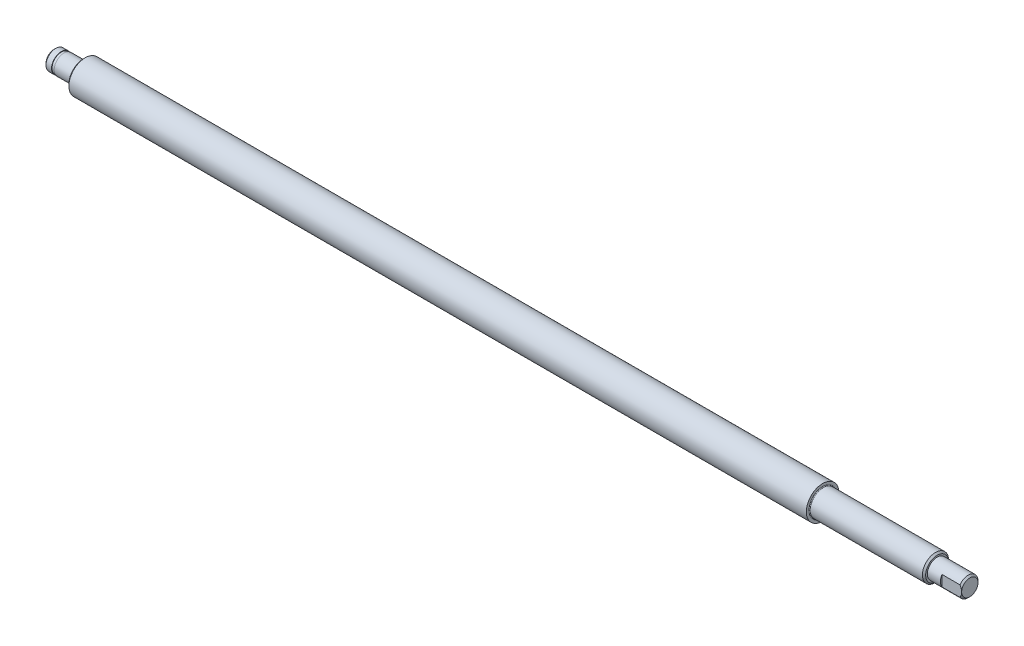
ISO-10303-21;
HEADER;
FILE_DESCRIPTION(('STEP AP214'),'2;1');
FILE_NAME('part.step','',(''),(''),'','','');
FILE_SCHEMA(('AUTOMOTIVE_DESIGN { 1 0 10303 214 1 1 1 1 }'));
ENDSEC;
DATA;
#1=APPLICATION_CONTEXT('core data for automotive mechanical design processes');
#2=APPLICATION_PROTOCOL_DEFINITION('international standard','automotive_design',2000,#1);
#3=PRODUCT_CONTEXT('',#1,'mechanical');
#4=PRODUCT('Part','Part','',(#3));
#5=PRODUCT_RELATED_PRODUCT_CATEGORY('part','',(#4));
#6=PRODUCT_DEFINITION_FORMATION('','',#4);
#7=PRODUCT_DEFINITION_CONTEXT('part definition',#1,'design');
#8=PRODUCT_DEFINITION('design','',#6,#7);
#9=PRODUCT_DEFINITION_SHAPE('','',#8);
#10=(LENGTH_UNIT() NAMED_UNIT(*) SI_UNIT(.MILLI.,.METRE.));
#11=(NAMED_UNIT(*) PLANE_ANGLE_UNIT() SI_UNIT($,.RADIAN.));
#12=(NAMED_UNIT(*) SI_UNIT($,.STERADIAN.) SOLID_ANGLE_UNIT());
#13=UNCERTAINTY_MEASURE_WITH_UNIT(LENGTH_MEASURE(1.E-05),#10,'distance_accuracy_value','');
#14=(GEOMETRIC_REPRESENTATION_CONTEXT(3) GLOBAL_UNCERTAINTY_ASSIGNED_CONTEXT((#13)) GLOBAL_UNIT_ASSIGNED_CONTEXT((#10,
#11,#12)) REPRESENTATION_CONTEXT('',''));
#15=CARTESIAN_POINT('',(0.,0.,0.));
#16=DIRECTION('',(0.,0.,1.));
#17=DIRECTION('',(1.,0.,0.));
#18=AXIS2_PLACEMENT_3D('',#15,#16,#17);
#19=CARTESIAN_POINT('',(0.,1.25,0.));
#20=DIRECTION('',(-1.,0.,0.));
#21=DIRECTION('',(0.,0.,1.));
#22=AXIS2_PLACEMENT_3D('',#19,#20,#21);
#23=PLANE('',#22);
#24=CARTESIAN_POINT('',(-5.6843418860808E-11,0.,0.));
#25=DIRECTION('',(1.,0.,0.));
#26=DIRECTION('',(0.,0.,-1.));
#27=AXIS2_PLACEMENT_3D('',#24,#25,#26);
#28=CIRCLE('',#27,2.49999999994088);
#29=CARTESIAN_POINT('',(-5.6843418860808E-11,0.,-2.49999999994088));
#30=VERTEX_POINT('',#29);
#31=EDGE_CURVE('E175',#30,#30,#28,.T.);
#32=ORIENTED_EDGE('',*,*,#31,.F.);
#33=EDGE_LOOP('',(#32));
#34=FACE_BOUND('',#33,.T.);
#35=ADVANCED_FACE('F17',(#34),#23,.T.);
#36=CARTESIAN_POINT('',(0.49999999987449,0.,0.));
#37=DIRECTION('',(1.,0.,0.));
#38=DIRECTION('',(0.,0.,-1.));
#39=AXIS2_PLACEMENT_3D('',#36,#37,#38);
#40=CONICAL_SURFACE('',#39,2.99999999987222,0.785398163397448);
#41=ORIENTED_EDGE('',*,*,#31,.T.);
#42=EDGE_LOOP('',(#41));
#43=FACE_BOUND('',#42,.T.);
#44=CARTESIAN_POINT('',(0.5,0.,0.));
#45=DIRECTION('',(1.,0.,0.));
#46=DIRECTION('',(0.,0.,-1.));
#47=AXIS2_PLACEMENT_3D('',#44,#45,#46);
#48=CIRCLE('',#47,3.);
#49=CARTESIAN_POINT('',(0.5,0.,-3.));
#50=VERTEX_POINT('',#49);
#51=EDGE_CURVE('E173',#50,#50,#48,.T.);
#52=ORIENTED_EDGE('',*,*,#51,.F.);
#53=EDGE_LOOP('',(#52));
#54=FACE_BOUND('',#53,.T.);
#55=ADVANCED_FACE('F208',(#43,#54),#40,.T.);
#56=CARTESIAN_POINT('',(1.35,0.,0.));
#57=DIRECTION('',(1.,0.,0.));
#58=DIRECTION('',(0.,0.,-1.));
#59=AXIS2_PLACEMENT_3D('',#56,#57,#58);
#60=CYLINDRICAL_SURFACE('',#59,3.);
#61=ORIENTED_EDGE('',*,*,#51,.T.);
#62=EDGE_LOOP('',(#61));
#63=FACE_BOUND('',#62,.T.);
#64=CARTESIAN_POINT('',(2.2,0.,0.));
#65=DIRECTION('',(1.,0.,0.));
#66=DIRECTION('',(0.,0.,-1.));
#67=AXIS2_PLACEMENT_3D('',#64,#65,#66);
#68=CIRCLE('',#67,3.);
#69=CARTESIAN_POINT('',(2.2,0.,-3.));
#70=VERTEX_POINT('',#69);
#71=EDGE_CURVE('E89',#70,#70,#68,.T.);
#72=ORIENTED_EDGE('',*,*,#71,.F.);
#73=EDGE_LOOP('',(#72));
#74=FACE_BOUND('',#73,.T.);
#75=ADVANCED_FACE('F206',(#63,#74),#60,.T.);
#76=CARTESIAN_POINT('',(280.,1.25,0.));
#77=DIRECTION('',(1.,0.,0.));
#78=DIRECTION('',(0.,0.,-1.));
#79=AXIS2_PLACEMENT_3D('',#76,#77,#78);
#80=PLANE('',#79);
#81=CARTESIAN_POINT('',(280.00000000003,0.,0.));
#82=DIRECTION('',(-1.,0.,0.));
#83=DIRECTION('',(0.,0.,1.));
#84=AXIS2_PLACEMENT_3D('',#81,#82,#83);
#85=CIRCLE('',#84,2.49999999994088);
#86=CARTESIAN_POINT('',(280.,0.,2.49999999997044));
#87=VERTEX_POINT('',#86);
#88=EDGE_CURVE('E73',#87,#87,#85,.T.);
#89=ORIENTED_EDGE('',*,*,#88,.F.);
#90=EDGE_LOOP('',(#89));
#91=FACE_BOUND('',#90,.T.);
#92=ADVANCED_FACE('F201',(#91),#80,.T.);
#93=CARTESIAN_POINT('',(2.2,2.925,0.));
#94=DIRECTION('',(1.,0.,0.));
#95=DIRECTION('',(0.,0.,-1.));
#96=AXIS2_PLACEMENT_3D('',#93,#94,#95);
#97=PLANE('',#96);
#98=CARTESIAN_POINT('',(2.2,0.,0.));
#99=DIRECTION('',(1.,0.,0.));
#100=DIRECTION('',(0.,0.,-1.));
#101=AXIS2_PLACEMENT_3D('',#98,#99,#100);
#102=CIRCLE('',#101,2.85);
#103=CARTESIAN_POINT('',(2.2,0.,-2.85));
#104=VERTEX_POINT('',#103);
#105=EDGE_CURVE('E80',#104,#104,#102,.T.);
#106=ORIENTED_EDGE('',*,*,#105,.F.);
#107=EDGE_LOOP('',(#106));
#108=FACE_BOUND('',#107,.T.);
#109=ORIENTED_EDGE('',*,*,#71,.T.);
#110=EDGE_LOOP('',(#109));
#111=FACE_BOUND('',#110,.T.);
#112=ADVANCED_FACE('F197',(#108,#111),#97,.T.);
#113=CARTESIAN_POINT('',(274.,0.,0.));
#114=DIRECTION('',(1.,0.,0.));
#115=DIRECTION('',(0.,0.,-1.));
#116=AXIS2_PLACEMENT_3D('',#113,#114,#115);
#117=PLANE('',#116);
#118=CARTESIAN_POINT('',(274.,0.,0.));
#119=DIRECTION('',(1.,0.,0.));
#120=DIRECTION('',(0.,0.,-1.));
#121=AXIS2_PLACEMENT_3D('',#118,#119,#120);
#122=CIRCLE('',#121,3.);
#123=CARTESIAN_POINT('',(274.,-1.6583123951777,2.5));
#124=VERTEX_POINT('',#123);
#125=CARTESIAN_POINT('',(274.,1.6583123951777,2.5));
#126=VERTEX_POINT('',#125);
#127=EDGE_CURVE('E170',#124,#126,#122,.F.);
#128=ORIENTED_EDGE('',*,*,#127,.F.);
#129=DIRECTION('',(0.,1.,0.));
#130=VECTOR('',#129,1.);
#131=CARTESIAN_POINT('',(274.,-3.,2.5));
#132=LINE('',#131,#130);
#133=EDGE_CURVE('E86',#124,#126,#132,.T.);
#134=ORIENTED_EDGE('',*,*,#133,.T.);
#135=EDGE_LOOP('',(#128,#134));
#136=FACE_BOUND('',#135,.T.);
#137=ADVANCED_FACE('F200',(#136),#117,.T.);
#138=CARTESIAN_POINT('',(280.,-3.,2.5));
#139=DIRECTION('',(0.,0.,-1.));
#140=DIRECTION('',(-1.,0.,0.));
#141=AXIS2_PLACEMENT_3D('',#138,#139,#140);
#142=PLANE('',#141);
#143=CARTESIAN_POINT('',(279.999999999968,0.,2.49999999999321));
#144=CARTESIAN_POINT('',(280.000064317608,-0.0768428391805299,2.49999999999757));
#145=CARTESIAN_POINT('',(279.996458566884,-0.153646619440529,2.49999999999935));
#146=CARTESIAN_POINT('',(279.982413818586,-0.306486913990937,2.50000000000065));
#147=CARTESIAN_POINT('',(279.97198775665,-0.382524604614896,2.50000000000017));
#148=CARTESIAN_POINT('',(279.945023188587,-0.532231201598621,2.49999999999983));
#149=CARTESIAN_POINT('',(279.928585134829,-0.605918543015384,2.49999999999995));
#150=CARTESIAN_POINT('',(279.890327769619,-0.751897163106975,2.50000000000005));
#151=CARTESIAN_POINT('',(279.868506360188,-0.824187885624829,2.50000000000001));
#152=CARTESIAN_POINT('',(279.822241706539,-0.96136120455839,2.49999999999999));
#153=CARTESIAN_POINT('',(279.798158162072,-1.02636662586179,2.5));
#154=CARTESIAN_POINT('',(279.746697199209,-1.15505562355113,2.5));
#155=CARTESIAN_POINT('',(279.719319639856,-1.21873914323443,2.5));
#156=CARTESIAN_POINT('',(279.661345046065,-1.34581351001021,2.5));
#157=CARTESIAN_POINT('',(279.63070451921,-1.40918435961285,2.5));
#158=CARTESIAN_POINT('',(279.567035036088,-1.53466113601577,2.5));
#159=CARTESIAN_POINT('',(279.534007794406,-1.59676793058607,2.5));
#160=CARTESIAN_POINT('',(279.499999999977,-1.65831239516516,2.5));
#161=B_SPLINE_CURVE_WITH_KNOTS('',3,(#143,#144,#145,#146,#147,#148,#149,#150,#151,#152,#153,
#154,#155,#156,#157,#158,#159,#160),.UNSPECIFIED.,.F.,.F.,(4,2,2,2,2,2,2,2,4),(0.,
0.230381722715322,0.460327757459484,0.686595219702935,0.912951001700785,1.12081935764148,
1.32869661169361,1.53981070701963,1.75077462021815),.UNSPECIFIED.);
#162=CARTESIAN_POINT('',(279.499999999989,-1.65831239517143,2.5));
#163=VERTEX_POINT('',#162);
#164=EDGE_CURVE('E76',#87,#163,#161,.T.);
#165=ORIENTED_EDGE('',*,*,#164,.F.);
#166=CARTESIAN_POINT('',(279.499999999984,1.65831239515839,2.50000000000526));
#167=CARTESIAN_POINT('',(279.525020025567,1.61304419069286,2.50000000000194));
#168=CARTESIAN_POINT('',(279.5494994272,1.56747781749029,2.50000000000053));
#169=CARTESIAN_POINT('',(279.597209686711,1.47571363153014,2.49999999999947));
#170=CARTESIAN_POINT('',(279.620440903858,1.42951600532336,2.49999999999981));
#171=CARTESIAN_POINT('',(279.688233741447,1.28946898248478,2.50000000000037));
#172=CARTESIAN_POINT('',(279.730668553478,1.19456817293894,2.5000000000001));
#173=CARTESIAN_POINT('',(279.807164131335,1.00435832659354,2.4999999999999));
#174=CARTESIAN_POINT('',(279.841418593213,0.909128166840024,2.49999999999997));
#175=CARTESIAN_POINT('',(279.901118638321,0.715960996386579,2.50000000000003));
#176=CARTESIAN_POINT('',(279.926570521279,0.618025975900858,2.50000000000001));
#177=CARTESIAN_POINT('',(279.963951416113,0.434096531025218,2.49999999999999));
#178=CARTESIAN_POINT('',(279.977292899303,0.348395131910192,2.5));
#179=CARTESIAN_POINT('',(279.990826654301,0.218706232964625,2.5));
#180=CARTESIAN_POINT('',(279.994258820536,0.175042274882193,2.5));
#181=CARTESIAN_POINT('',(279.998848454712,0.0875881850195385,2.5));
#182=CARTESIAN_POINT('',(280.000005550177,0.0437980337540324,2.5));
#183=CARTESIAN_POINT('',(279.99999999997,5.79945179342653E-13,2.5));
#184=B_SPLINE_CURVE_WITH_KNOTS('',3,(#166,#167,#168,#169,#170,#171,#172,#173,#174,#175,#176,
#177,#178,#179,#180,#181,#182,#183),.UNSPECIFIED.,.F.,.F.,(4,2,2,2,2,2,2,2,4),(0.,
0.155160114660443,0.310275326951778,0.621889187463361,0.925164565299161,1.22822244719404,
1.48798349651515,1.61932602445735,1.75069005404199),.UNSPECIFIED.);
#185=CARTESIAN_POINT('',(279.499999999991,1.6583123951674,2.5));
#186=VERTEX_POINT('',#185);
#187=EDGE_CURVE('E78',#186,#87,#184,.T.);
#188=ORIENTED_EDGE('',*,*,#187,.F.);
#189=DIRECTION('',(1.,0.,0.));
#190=VECTOR('',#189,1.);
#191=CARTESIAN_POINT('',(274.75,1.6583123951777,2.5));
#192=LINE('',#191,#190);
#193=EDGE_CURVE('E167',#126,#186,#192,.T.);
#194=ORIENTED_EDGE('',*,*,#193,.F.);
#195=ORIENTED_EDGE('',*,*,#133,.F.);
#196=DIRECTION('',(1.,0.,0.));
#197=VECTOR('',#196,1.);
#198=CARTESIAN_POINT('',(274.75,-1.6583123951777,2.5));
#199=LINE('',#198,#197);
#200=EDGE_CURVE('E85',#163,#124,#199,.F.);
#201=ORIENTED_EDGE('',*,*,#200,.F.);
#202=EDGE_LOOP('',(#165,#188,#194,#195,#201));
#203=FACE_BOUND('',#202,.T.);
#204=ADVANCED_FACE('F83',(#203),#142,.F.);
#205=CARTESIAN_POINT('',(279.500000000098,0.,0.));
#206=DIRECTION('',(-1.,0.,0.));
#207=DIRECTION('',(0.,0.,1.));
#208=AXIS2_PLACEMENT_3D('',#205,#206,#207);
#209=CONICAL_SURFACE('',#208,2.99999999987222,0.785398163397448);
#210=ORIENTED_EDGE('',*,*,#187,.T.);
#211=ORIENTED_EDGE('',*,*,#88,.T.);
#212=ORIENTED_EDGE('',*,*,#164,.T.);
#213=CARTESIAN_POINT('',(279.5,0.,0.));
#214=DIRECTION('',(1.,0.,0.));
#215=DIRECTION('',(0.,0.,-1.));
#216=AXIS2_PLACEMENT_3D('',#213,#214,#215);
#217=CIRCLE('',#216,3.);
#218=EDGE_CURVE('E67',#186,#163,#217,.F.);
#219=ORIENTED_EDGE('',*,*,#218,.F.);
#220=EDGE_LOOP('',(#210,#211,#212,#219));
#221=FACE_BOUND('',#220,.T.);
#222=ADVANCED_FACE('F75',(#221),#209,.T.);
#223=CARTESIAN_POINT('',(2.6,0.,0.));
#224=DIRECTION('',(1.,0.,0.));
#225=DIRECTION('',(0.,0.,-1.));
#226=AXIS2_PLACEMENT_3D('',#223,#224,#225);
#227=CYLINDRICAL_SURFACE('',#226,2.85);
#228=ORIENTED_EDGE('',*,*,#105,.T.);
#229=EDGE_LOOP('',(#228));
#230=FACE_BOUND('',#229,.T.);
#231=CARTESIAN_POINT('',(3.,0.,0.));
#232=DIRECTION('',(1.,0.,0.));
#233=DIRECTION('',(0.,0.,-1.));
#234=AXIS2_PLACEMENT_3D('',#231,#232,#233);
#235=CIRCLE('',#234,2.85);
#236=CARTESIAN_POINT('',(3.,0.,-2.85));
#237=VERTEX_POINT('',#236);
#238=EDGE_CURVE('E166',#237,#237,#235,.T.);
#239=ORIENTED_EDGE('',*,*,#238,.F.);
#240=EDGE_LOOP('',(#239));
#241=FACE_BOUND('',#240,.T.);
#242=ADVANCED_FACE('F106',(#230,#241),#227,.T.);
#243=CARTESIAN_POINT('',(274.75,0.,0.));
#244=DIRECTION('',(1.,0.,0.));
#245=DIRECTION('',(0.,0.,-1.));
#246=AXIS2_PLACEMENT_3D('',#243,#244,#245);
#247=CYLINDRICAL_SURFACE('',#246,3.);
#248=CARTESIAN_POINT('',(270.,0.,0.));
#249=DIRECTION('',(1.,0.,0.));
#250=DIRECTION('',(0.,0.,-1.));
#251=AXIS2_PLACEMENT_3D('',#248,#249,#250);
#252=CIRCLE('',#251,3.);
#253=CARTESIAN_POINT('',(270.,0.,-3.));
#254=VERTEX_POINT('',#253);
#255=EDGE_CURVE('E186',#254,#254,#252,.F.);
#256=ORIENTED_EDGE('',*,*,#255,.F.);
#257=EDGE_LOOP('',(#256));
#258=FACE_BOUND('',#257,.T.);
#259=ORIENTED_EDGE('',*,*,#193,.T.);
#260=ORIENTED_EDGE('',*,*,#218,.T.);
#261=ORIENTED_EDGE('',*,*,#200,.T.);
#262=ORIENTED_EDGE('',*,*,#127,.T.);
#263=EDGE_LOOP('',(#259,#260,#261,#262));
#264=FACE_BOUND('',#263,.T.);
#265=ADVANCED_FACE('F110',(#258,#264),#247,.T.);
#266=CARTESIAN_POINT('',(3.,2.925,0.));
#267=DIRECTION('',(-1.,0.,0.));
#268=DIRECTION('',(0.,0.,1.));
#269=AXIS2_PLACEMENT_3D('',#266,#267,#268);
#270=PLANE('',#269);
#271=CARTESIAN_POINT('',(3.,0.,0.));
#272=DIRECTION('',(1.,0.,0.));
#273=DIRECTION('',(0.,0.,-1.));
#274=AXIS2_PLACEMENT_3D('',#271,#272,#273);
#275=CIRCLE('',#274,3.);
#276=CARTESIAN_POINT('',(3.,0.,-3.));
#277=VERTEX_POINT('',#276);
#278=EDGE_CURVE('E183',#277,#277,#275,.T.);
#279=ORIENTED_EDGE('',*,*,#278,.F.);
#280=EDGE_LOOP('',(#279));
#281=FACE_BOUND('',#280,.T.);
#282=ORIENTED_EDGE('',*,*,#238,.T.);
#283=EDGE_LOOP('',(#282));
#284=FACE_BOUND('',#283,.T.);
#285=ADVANCED_FACE('F114',(#281,#284),#270,.T.);
#286=CARTESIAN_POINT('',(270.,3.25,0.));
#287=DIRECTION('',(1.,0.,0.));
#288=DIRECTION('',(0.,0.,-1.));
#289=AXIS2_PLACEMENT_3D('',#286,#287,#288);
#290=PLANE('',#289);
#291=ORIENTED_EDGE('',*,*,#255,.T.);
#292=EDGE_LOOP('',(#291));
#293=FACE_BOUND('',#292,.T.);
#294=CARTESIAN_POINT('',(270.000000000039,0.,0.));
#295=DIRECTION('',(-1.,0.,0.));
#296=DIRECTION('',(0.,0.,1.));
#297=AXIS2_PLACEMENT_3D('',#294,#295,#296);
#298=CIRCLE('',#297,3.49999999997408);
#299=CARTESIAN_POINT('',(270.000000000039,0.,3.49999999997408));
#300=VERTEX_POINT('',#299);
#301=EDGE_CURVE('E164',#300,#300,#298,.T.);
#302=ORIENTED_EDGE('',*,*,#301,.F.);
#303=EDGE_LOOP('',(#302));
#304=FACE_BOUND('',#303,.T.);
#305=ADVANCED_FACE('F118',(#293,#304),#290,.T.);
#306=CARTESIAN_POINT('',(5.9,0.,0.));
#307=DIRECTION('',(1.,0.,0.));
#308=DIRECTION('',(0.,0.,-1.));
#309=AXIS2_PLACEMENT_3D('',#306,#307,#308);
#310=CYLINDRICAL_SURFACE('',#309,3.);
#311=ORIENTED_EDGE('',*,*,#278,.T.);
#312=EDGE_LOOP('',(#311));
#313=FACE_BOUND('',#312,.T.);
#314=CARTESIAN_POINT('',(8.8,0.,0.));
#315=DIRECTION('',(-1.,0.,0.));
#316=DIRECTION('',(0.,0.,1.));
#317=AXIS2_PLACEMENT_3D('',#314,#315,#316);
#318=CIRCLE('',#317,3.);
#319=CARTESIAN_POINT('',(8.8,0.,3.));
#320=VERTEX_POINT('',#319);
#321=EDGE_CURVE('E161',#320,#320,#318,.T.);
#322=ORIENTED_EDGE('',*,*,#321,.T.);
#323=EDGE_LOOP('',(#322));
#324=FACE_BOUND('',#323,.T.);
#325=ADVANCED_FACE('F122',(#313,#324),#310,.T.);
#326=CARTESIAN_POINT('',(269.499999999994,0.,0.));
#327=DIRECTION('',(-1.,0.,0.));
#328=DIRECTION('',(0.,0.,1.));
#329=AXIS2_PLACEMENT_3D('',#326,#327,#328);
#330=CONICAL_SURFACE('',#329,3.99999999996226,0.785398163340605);
#331=CARTESIAN_POINT('',(269.5,0.,0.));
#332=DIRECTION('',(1.,0.,0.));
#333=DIRECTION('',(0.,0.,-1.));
#334=AXIS2_PLACEMENT_3D('',#331,#332,#333);
#335=CIRCLE('',#334,4.00000000000001);
#336=CARTESIAN_POINT('',(269.5,0.,-4.00000000000001));
#337=VERTEX_POINT('',#336);
#338=EDGE_CURVE('E152',#337,#337,#335,.F.);
#339=ORIENTED_EDGE('',*,*,#338,.F.);
#340=EDGE_LOOP('',(#339));
#341=FACE_BOUND('',#340,.T.);
#342=ORIENTED_EDGE('',*,*,#301,.T.);
#343=EDGE_LOOP('',(#342));
#344=FACE_BOUND('',#343,.T.);
#345=ADVANCED_FACE('F126',(#341,#344),#330,.T.);
#346=CARTESIAN_POINT('',(8.8,0.,0.));
#347=DIRECTION('',(-1.,0.,0.));
#348=DIRECTION('',(0.,0.,1.));
#349=AXIS2_PLACEMENT_3D('',#346,#347,#348);
#350=TOROIDAL_SURFACE('',#349,3.2,0.199999999999999);
#351=CARTESIAN_POINT('',(9.,0.,0.));
#352=DIRECTION('',(-1.,0.,0.));
#353=DIRECTION('',(0.,0.,-1.));
#354=AXIS2_PLACEMENT_3D('',#351,#352,#353);
#355=CIRCLE('',#354,3.2);
#356=CARTESIAN_POINT('',(9.,0.,3.2));
#357=VERTEX_POINT('',#356);
#358=CARTESIAN_POINT('',(9.,0.,-3.2));
#359=VERTEX_POINT('',#358);
#360=EDGE_CURVE('E147',#357,#359,#355,.F.);
#361=ORIENTED_EDGE('',*,*,#360,.F.);
#362=CARTESIAN_POINT('',(9.,0.,0.));
#363=DIRECTION('',(-1.,0.,0.));
#364=DIRECTION('',(0.,0.,1.));
#365=AXIS2_PLACEMENT_3D('',#362,#363,#364);
#366=CIRCLE('',#365,3.2);
#367=CARTESIAN_POINT('',(9.,3.2,0.));
#368=VERTEX_POINT('',#367);
#369=EDGE_CURVE('E298',#368,#357,#366,.F.);
#370=ORIENTED_EDGE('',*,*,#369,.F.);
#371=CARTESIAN_POINT('',(9.,0.,0.));
#372=DIRECTION('',(-1.,0.,0.));
#373=DIRECTION('',(0.,1.,0.));
#374=AXIS2_PLACEMENT_3D('',#371,#372,#373);
#375=CIRCLE('',#374,3.2);
#376=EDGE_CURVE('E160',#359,#368,#375,.F.);
#377=ORIENTED_EDGE('',*,*,#376,.F.);
#378=EDGE_LOOP('',(#361,#370,#377));
#379=FACE_BOUND('',#378,.T.);
#380=ORIENTED_EDGE('',*,*,#321,.F.);
#381=EDGE_LOOP('',(#380));
#382=FACE_BOUND('',#381,.T.);
#383=ADVANCED_FACE('F129',(#379,#382),#350,.F.);
#384=CARTESIAN_POINT('',(252.35,0.,0.));
#385=DIRECTION('',(1.,0.,0.));
#386=DIRECTION('',(0.,0.,-1.));
#387=AXIS2_PLACEMENT_3D('',#384,#385,#386);
#388=CYLINDRICAL_SURFACE('',#387,4.00000000000001);
#389=CARTESIAN_POINT('',(235.2,0.,0.));
#390=DIRECTION('',(-1.,0.,0.));
#391=DIRECTION('',(0.,0.,1.));
#392=AXIS2_PLACEMENT_3D('',#389,#390,#391);
#393=CIRCLE('',#392,4.00000000000001);
#394=CARTESIAN_POINT('',(235.2,0.,4.00000000000001));
#395=VERTEX_POINT('',#394);
#396=EDGE_CURVE('E144',#395,#395,#393,.F.);
#397=ORIENTED_EDGE('',*,*,#396,.T.);
#398=EDGE_LOOP('',(#397));
#399=FACE_BOUND('',#398,.T.);
#400=ORIENTED_EDGE('',*,*,#338,.T.);
#401=EDGE_LOOP('',(#400));
#402=FACE_BOUND('',#401,.T.);
#403=ADVANCED_FACE('F135',(#399,#402),#388,.T.);
#404=CARTESIAN_POINT('',(9.,3.85,0.));
#405=DIRECTION('',(-1.,0.,0.));
#406=DIRECTION('',(0.,0.,1.));
#407=AXIS2_PLACEMENT_3D('',#404,#405,#406);
#408=PLANE('',#407);
#409=CARTESIAN_POINT('',(8.99999999995771,0.,0.));
#410=DIRECTION('',(1.,0.,0.));
#411=DIRECTION('',(0.,0.,-1.));
#412=AXIS2_PLACEMENT_3D('',#409,#410,#411);
#413=CIRCLE('',#412,4.50000000000728);
#414=CARTESIAN_POINT('',(8.99999999995771,0.,-4.50000000000728));
#415=VERTEX_POINT('',#414);
#416=EDGE_CURVE('E177',#415,#415,#413,.T.);
#417=ORIENTED_EDGE('',*,*,#416,.F.);
#418=EDGE_LOOP('',(#417));
#419=FACE_BOUND('',#418,.T.);
#420=ORIENTED_EDGE('',*,*,#369,.T.);
#421=ORIENTED_EDGE('',*,*,#360,.T.);
#422=ORIENTED_EDGE('',*,*,#376,.T.);
#423=EDGE_LOOP('',(#420,#421,#422));
#424=FACE_BOUND('',#423,.T.);
#425=ADVANCED_FACE('F269',(#419,#424),#408,.T.);
#426=CARTESIAN_POINT('',(235.2,0.,0.));
#427=DIRECTION('',(-1.,0.,0.));
#428=DIRECTION('',(0.,0.,1.));
#429=AXIS2_PLACEMENT_3D('',#426,#427,#428);
#430=TOROIDAL_SURFACE('',#429,4.19999999999997,0.19999999999996);
#431=CARTESIAN_POINT('',(235.,0.,0.));
#432=DIRECTION('',(1.,0.,0.));
#433=DIRECTION('',(0.,1.,0.));
#434=AXIS2_PLACEMENT_3D('',#431,#432,#433);
#435=CIRCLE('',#434,4.19999999999999);
#436=CARTESIAN_POINT('',(235.,0.,4.19999999999999));
#437=VERTEX_POINT('',#436);
#438=CARTESIAN_POINT('',(235.,4.2,0.));
#439=VERTEX_POINT('',#438);
#440=EDGE_CURVE('E37',#437,#439,#435,.F.);
#441=ORIENTED_EDGE('',*,*,#440,.F.);
#442=CARTESIAN_POINT('',(235.,0.,0.));
#443=DIRECTION('',(1.,0.,0.));
#444=DIRECTION('',(0.,0.,1.));
#445=AXIS2_PLACEMENT_3D('',#442,#443,#444);
#446=CIRCLE('',#445,4.19999999999999);
#447=CARTESIAN_POINT('',(235.,0.,-4.19999999999999));
#448=VERTEX_POINT('',#447);
#449=EDGE_CURVE('E253',#448,#437,#446,.F.);
#450=ORIENTED_EDGE('',*,*,#449,.F.);
#451=CARTESIAN_POINT('',(235.,0.,0.));
#452=DIRECTION('',(1.,0.,0.));
#453=DIRECTION('',(0.,0.,-1.));
#454=AXIS2_PLACEMENT_3D('',#451,#452,#453);
#455=CIRCLE('',#454,4.2);
#456=EDGE_CURVE('E180',#439,#448,#455,.F.);
#457=ORIENTED_EDGE('',*,*,#456,.F.);
#458=EDGE_LOOP('',(#441,#450,#457));
#459=FACE_BOUND('',#458,.T.);
#460=ORIENTED_EDGE('',*,*,#396,.F.);
#461=EDGE_LOOP('',(#460));
#462=FACE_BOUND('',#461,.T.);
#463=ADVANCED_FACE('F266',(#459,#462),#430,.F.);
#464=CARTESIAN_POINT('',(9.50000000000273,0.,0.));
#465=DIRECTION('',(1.,0.,0.));
#466=DIRECTION('',(0.,0.,-1.));
#467=AXIS2_PLACEMENT_3D('',#464,#465,#466);
#468=CONICAL_SURFACE('',#467,4.99999999999545,0.785398163340605);
#469=ORIENTED_EDGE('',*,*,#416,.T.);
#470=EDGE_LOOP('',(#469));
#471=FACE_BOUND('',#470,.T.);
#472=CARTESIAN_POINT('',(9.49999999999999,0.,0.));
#473=DIRECTION('',(1.,0.,0.));
#474=DIRECTION('',(0.,0.,-1.));
#475=AXIS2_PLACEMENT_3D('',#472,#473,#474);
#476=CIRCLE('',#475,5.);
#477=CARTESIAN_POINT('',(9.49999999999999,0.,-5.));
#478=VERTEX_POINT('',#477);
#479=EDGE_CURVE('E28',#478,#478,#476,.T.);
#480=ORIENTED_EDGE('',*,*,#479,.F.);
#481=EDGE_LOOP('',(#480));
#482=FACE_BOUND('',#481,.T.);
#483=ADVANCED_FACE('F226',(#471,#482),#468,.T.);
#484=CARTESIAN_POINT('',(235.,4.6,0.));
#485=DIRECTION('',(1.,0.,0.));
#486=DIRECTION('',(0.,0.,-1.));
#487=AXIS2_PLACEMENT_3D('',#484,#485,#486);
#488=PLANE('',#487);
#489=ORIENTED_EDGE('',*,*,#449,.T.);
#490=ORIENTED_EDGE('',*,*,#440,.T.);
#491=ORIENTED_EDGE('',*,*,#456,.T.);
#492=EDGE_LOOP('',(#489,#490,#491));
#493=FACE_BOUND('',#492,.T.);
#494=CARTESIAN_POINT('',(235.,0.,0.));
#495=DIRECTION('',(1.,0.,0.));
#496=DIRECTION('',(0.,0.,-1.));
#497=AXIS2_PLACEMENT_3D('',#494,#495,#496);
#498=CIRCLE('',#497,5.);
#499=CARTESIAN_POINT('',(235.,0.,-5.));
#500=VERTEX_POINT('',#499);
#501=EDGE_CURVE('E11',#500,#500,#498,.F.);
#502=ORIENTED_EDGE('',*,*,#501,.F.);
#503=EDGE_LOOP('',(#502));
#504=FACE_BOUND('',#503,.T.);
#505=ADVANCED_FACE('F220',(#493,#504),#488,.T.);
#506=CARTESIAN_POINT('',(122.25,0.,0.));
#507=DIRECTION('',(1.,0.,0.));
#508=DIRECTION('',(0.,0.,-1.));
#509=AXIS2_PLACEMENT_3D('',#506,#507,#508);
#510=CYLINDRICAL_SURFACE('',#509,5.);
#511=ORIENTED_EDGE('',*,*,#479,.T.);
#512=EDGE_LOOP('',(#511));
#513=FACE_BOUND('',#512,.T.);
#514=ORIENTED_EDGE('',*,*,#501,.T.);
#515=EDGE_LOOP('',(#514));
#516=FACE_BOUND('',#515,.T.);
#517=ADVANCED_FACE('F218',(#513,#516),#510,.T.);
#518=CLOSED_SHELL('',(#35,#55,#75,#92,#112,#137,#204,#222,#242,#265,#285,#305,#325,#345,#383,
#403,#425,#463,#483,#505,#517));
#519=MANIFOLD_SOLID_BREP('B1',#518);
#520=ADVANCED_BREP_SHAPE_REPRESENTATION('',(#18,#519),#14);
#521=SHAPE_DEFINITION_REPRESENTATION(#9,#520);
ENDSEC;
END-ISO-10303-21;
